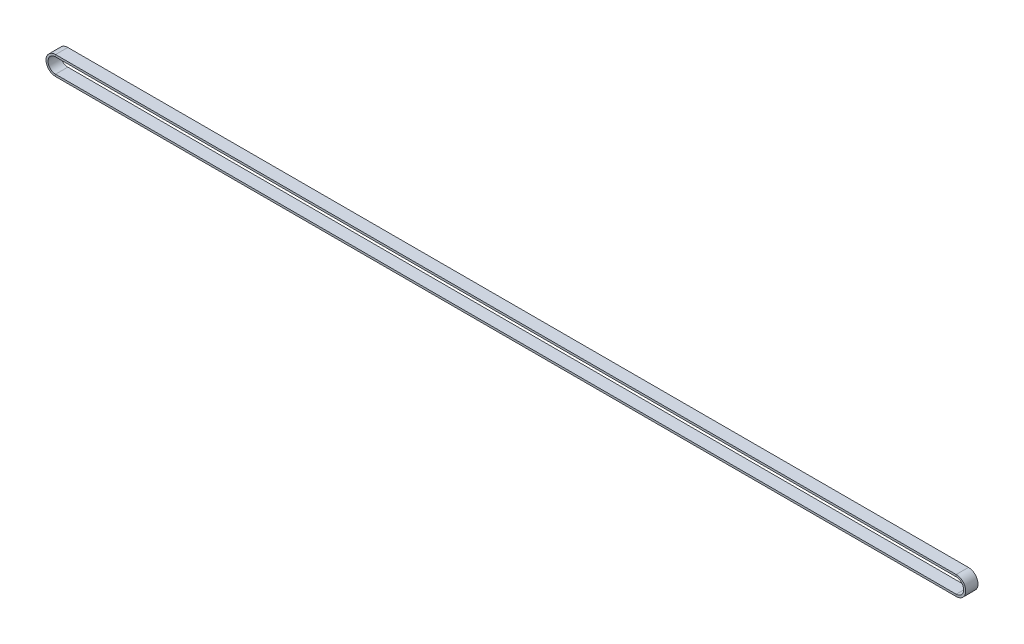
ISO-10303-21;
HEADER;
FILE_DESCRIPTION(('STEP AP214'),'2;1');
FILE_NAME('part.step','',(''),(''),'','','');
FILE_SCHEMA(('AUTOMOTIVE_DESIGN { 1 0 10303 214 1 1 1 1 }'));
ENDSEC;
DATA;
#1=APPLICATION_CONTEXT('core data for automotive mechanical design processes');
#2=APPLICATION_PROTOCOL_DEFINITION('international standard','automotive_design',2000,#1);
#3=PRODUCT_CONTEXT('',#1,'mechanical');
#4=PRODUCT('Part','Part','',(#3));
#5=PRODUCT_RELATED_PRODUCT_CATEGORY('part','',(#4));
#6=PRODUCT_DEFINITION_FORMATION('','',#4);
#7=PRODUCT_DEFINITION_CONTEXT('part definition',#1,'design');
#8=PRODUCT_DEFINITION('design','',#6,#7);
#9=PRODUCT_DEFINITION_SHAPE('','',#8);
#10=(LENGTH_UNIT() NAMED_UNIT(*) SI_UNIT(.MILLI.,.METRE.));
#11=(NAMED_UNIT(*) PLANE_ANGLE_UNIT() SI_UNIT($,.RADIAN.));
#12=(NAMED_UNIT(*) SI_UNIT($,.STERADIAN.) SOLID_ANGLE_UNIT());
#13=UNCERTAINTY_MEASURE_WITH_UNIT(LENGTH_MEASURE(1.E-05),#10,'distance_accuracy_value','');
#14=(GEOMETRIC_REPRESENTATION_CONTEXT(3) GLOBAL_UNCERTAINTY_ASSIGNED_CONTEXT((#13)) GLOBAL_UNIT_ASSIGNED_CONTEXT((#10,
#11,#12)) REPRESENTATION_CONTEXT('',''));
#15=CARTESIAN_POINT('',(0.,0.,0.));
#16=DIRECTION('',(0.,0.,1.));
#17=DIRECTION('',(1.,0.,0.));
#18=AXIS2_PLACEMENT_3D('',#15,#16,#17);
#19=CARTESIAN_POINT('',(-660.332653819081,7.00000000000147,0.));
#20=DIRECTION('',(0.,1.,0.));
#21=DIRECTION('',(-1.,0.,0.));
#22=AXIS2_PLACEMENT_3D('',#19,#20,#21);
#23=PLANE('',#22);
#24=DIRECTION('',(1.,0.,0.));
#25=VECTOR('',#24,1.);
#26=CARTESIAN_POINT('',(-660.332653819081,7.00000000000147,0.));
#27=LINE('',#26,#25);
#28=CARTESIAN_POINT('',(-660.332653819081,7.00000000000147,0.));
#29=VERTEX_POINT('',#28);
#30=CARTESIAN_POINT('',(0.,7.,0.));
#31=VERTEX_POINT('',#30);
#32=EDGE_CURVE('E11',#29,#31,#27,.T.);
#33=ORIENTED_EDGE('',*,*,#32,.T.);
#34=DIRECTION('',(0.,0.,-1.));
#35=VECTOR('',#34,1.);
#36=CARTESIAN_POINT('',(0.,7.,0.));
#37=LINE('',#36,#35);
#38=CARTESIAN_POINT('',(0.,7.,-9.));
#39=VERTEX_POINT('',#38);
#40=EDGE_CURVE('E143',#31,#39,#37,.T.);
#41=ORIENTED_EDGE('',*,*,#40,.T.);
#42=DIRECTION('',(1.,0.,0.));
#43=VECTOR('',#42,1.);
#44=CARTESIAN_POINT('',(-660.332653819081,7.00000000000147,-9.));
#45=LINE('',#44,#43);
#46=CARTESIAN_POINT('',(-660.332653819081,7.00000000000147,-9.));
#47=VERTEX_POINT('',#46);
#48=EDGE_CURVE('E149',#47,#39,#45,.T.);
#49=ORIENTED_EDGE('',*,*,#48,.F.);
#50=DIRECTION('',(0.,0.,-1.));
#51=VECTOR('',#50,1.);
#52=CARTESIAN_POINT('',(-660.332653819081,7.00000000000147,0.));
#53=LINE('',#52,#51);
#54=EDGE_CURVE('E38',#29,#47,#53,.T.);
#55=ORIENTED_EDGE('',*,*,#54,.F.);
#56=EDGE_LOOP('',(#33,#41,#49,#55));
#57=FACE_BOUND('',#56,.T.);
#58=ADVANCED_FACE('F35',(#57),#23,.T.);
#59=CARTESIAN_POINT('',(-660.332653819081,7.00000000000147,0.));
#60=DIRECTION('',(0.,0.,1.));
#61=DIRECTION('',(0.,1.,0.));
#62=AXIS2_PLACEMENT_3D('',#59,#60,#61);
#63=PLANE('',#62);
#64=DIRECTION('',(1.,0.,0.));
#65=VECTOR('',#64,1.);
#66=CARTESIAN_POINT('',(-660.332653819081,5.50000000000147,0.));
#67=LINE('',#66,#65);
#68=CARTESIAN_POINT('',(-660.332653819081,5.50000000000147,0.));
#69=VERTEX_POINT('',#68);
#70=CARTESIAN_POINT('',(0.,5.5,0.));
#71=VERTEX_POINT('',#70);
#72=EDGE_CURVE('E43',#69,#71,#67,.T.);
#73=ORIENTED_EDGE('',*,*,#72,.T.);
#74=DIRECTION('',(0.,1.,0.));
#75=VECTOR('',#74,1.);
#76=CARTESIAN_POINT('',(0.,7.,0.));
#77=LINE('',#76,#75);
#78=EDGE_CURVE('E158',#71,#31,#77,.T.);
#79=ORIENTED_EDGE('',*,*,#78,.T.);
#80=ORIENTED_EDGE('',*,*,#32,.F.);
#81=DIRECTION('',(0.,1.,0.));
#82=VECTOR('',#81,1.);
#83=CARTESIAN_POINT('',(-660.332653819081,7.00000000000147,0.));
#84=LINE('',#83,#82);
#85=EDGE_CURVE('E175',#69,#29,#84,.T.);
#86=ORIENTED_EDGE('',*,*,#85,.F.);
#87=EDGE_LOOP('',(#73,#79,#80,#86));
#88=FACE_BOUND('',#87,.T.);
#89=ADVANCED_FACE('F180',(#88),#63,.T.);
#90=CARTESIAN_POINT('',(-660.332653819081,5.50000000000147,0.));
#91=DIRECTION('',(0.,-1.,0.));
#92=DIRECTION('',(1.,0.,0.));
#93=AXIS2_PLACEMENT_3D('',#90,#91,#92);
#94=PLANE('',#93);
#95=DIRECTION('',(1.,0.,0.));
#96=VECTOR('',#95,1.);
#97=CARTESIAN_POINT('',(-660.332653819081,5.50000000000147,-9.));
#98=LINE('',#97,#96);
#99=CARTESIAN_POINT('',(-660.332653819081,5.50000000000147,-9.));
#100=VERTEX_POINT('',#99);
#101=CARTESIAN_POINT('',(0.,5.5,-9.));
#102=VERTEX_POINT('',#101);
#103=EDGE_CURVE('E155',#100,#102,#98,.T.);
#104=ORIENTED_EDGE('',*,*,#103,.T.);
#105=DIRECTION('',(0.,0.,1.));
#106=VECTOR('',#105,1.);
#107=CARTESIAN_POINT('',(0.,5.5,0.));
#108=LINE('',#107,#106);
#109=EDGE_CURVE('E136',#102,#71,#108,.T.);
#110=ORIENTED_EDGE('',*,*,#109,.T.);
#111=ORIENTED_EDGE('',*,*,#72,.F.);
#112=DIRECTION('',(0.,0.,1.));
#113=VECTOR('',#112,1.);
#114=CARTESIAN_POINT('',(-660.332653819081,5.50000000000147,0.));
#115=LINE('',#114,#113);
#116=EDGE_CURVE('E188',#100,#69,#115,.T.);
#117=ORIENTED_EDGE('',*,*,#116,.F.);
#118=EDGE_LOOP('',(#104,#110,#111,#117));
#119=FACE_BOUND('',#118,.T.);
#120=ADVANCED_FACE('F216',(#119),#94,.T.);
#121=CARTESIAN_POINT('',(-660.332653819081,1.45716771982052E-12,0.));
#122=DIRECTION('',(0.,0.,1.));
#123=DIRECTION('',(-1.,0.,0.));
#124=AXIS2_PLACEMENT_3D('',#121,#122,#123);
#125=CYLINDRICAL_SURFACE('',#124,7.00000000000001);
#126=ORIENTED_EDGE('',*,*,#54,.T.);
#127=CARTESIAN_POINT('',(-660.332653819081,1.45716771982052E-12,-9.));
#128=DIRECTION('',(0.,0.,-1.));
#129=DIRECTION('',(0.,-1.,0.));
#130=AXIS2_PLACEMENT_3D('',#127,#128,#129);
#131=CIRCLE('',#130,7.00000000000001);
#132=CARTESIAN_POINT('',(-660.332653819081,-6.99999999999853,-9.));
#133=VERTEX_POINT('',#132);
#134=EDGE_CURVE('E167',#133,#47,#131,.T.);
#135=ORIENTED_EDGE('',*,*,#134,.F.);
#136=DIRECTION('',(0.,0.,-1.));
#137=VECTOR('',#136,1.);
#138=CARTESIAN_POINT('',(-660.332653819081,-6.99999999999856,0.));
#139=LINE('',#138,#137);
#140=CARTESIAN_POINT('',(-660.332653819081,-6.99999999999853,0.));
#141=VERTEX_POINT('',#140);
#142=EDGE_CURVE('E166',#141,#133,#139,.T.);
#143=ORIENTED_EDGE('',*,*,#142,.F.);
#144=CARTESIAN_POINT('',(-660.332653819081,1.45716771982052E-12,0.));
#145=DIRECTION('',(0.,0.,-1.));
#146=DIRECTION('',(0.,-1.,0.));
#147=AXIS2_PLACEMENT_3D('',#144,#145,#146);
#148=CIRCLE('',#147,7.00000000000001);
#149=EDGE_CURVE('E51',#141,#29,#148,.T.);
#150=ORIENTED_EDGE('',*,*,#149,.T.);
#151=EDGE_LOOP('',(#126,#135,#143,#150));
#152=FACE_BOUND('',#151,.T.);
#153=ADVANCED_FACE('F176',(#152),#125,.T.);
#154=CARTESIAN_POINT('',(-660.332653819081,-6.99999999999856,0.));
#155=DIRECTION('',(0.,0.,1.));
#156=DIRECTION('',(-1.,0.,0.));
#157=AXIS2_PLACEMENT_3D('',#154,#155,#156);
#158=PLANE('',#157);
#159=ORIENTED_EDGE('',*,*,#149,.F.);
#160=DIRECTION('',(0.,-1.,0.));
#161=VECTOR('',#160,1.);
#162=CARTESIAN_POINT('',(-660.332653819081,-6.99999999999856,0.));
#163=LINE('',#162,#161);
#164=CARTESIAN_POINT('',(-660.332653819081,-5.49999999999853,0.));
#165=VERTEX_POINT('',#164);
#166=EDGE_CURVE('E170',#165,#141,#163,.T.);
#167=ORIENTED_EDGE('',*,*,#166,.F.);
#168=CARTESIAN_POINT('',(-660.332653819081,1.45716771982052E-12,0.));
#169=DIRECTION('',(0.,0.,-1.));
#170=DIRECTION('',(0.,-1.,0.));
#171=AXIS2_PLACEMENT_3D('',#168,#169,#170);
#172=CIRCLE('',#171,5.50000000000001);
#173=EDGE_CURVE('E59',#165,#69,#172,.T.);
#174=ORIENTED_EDGE('',*,*,#173,.T.);
#175=ORIENTED_EDGE('',*,*,#85,.T.);
#176=EDGE_LOOP('',(#159,#167,#174,#175));
#177=FACE_BOUND('',#176,.T.);
#178=ADVANCED_FACE('F232',(#177),#158,.T.);
#179=CARTESIAN_POINT('',(-660.332653819081,1.45716771982052E-12,0.));
#180=DIRECTION('',(0.,0.,1.));
#181=DIRECTION('',(-1.,0.,0.));
#182=AXIS2_PLACEMENT_3D('',#179,#180,#181);
#183=CYLINDRICAL_SURFACE('',#182,5.50000000000001);
#184=ORIENTED_EDGE('',*,*,#173,.F.);
#185=DIRECTION('',(0.,0.,1.));
#186=VECTOR('',#185,1.);
#187=CARTESIAN_POINT('',(-660.332653819081,-5.49999999999856,0.));
#188=LINE('',#187,#186);
#189=CARTESIAN_POINT('',(-660.332653819081,-5.49999999999853,-9.));
#190=VERTEX_POINT('',#189);
#191=EDGE_CURVE('E192',#190,#165,#188,.T.);
#192=ORIENTED_EDGE('',*,*,#191,.F.);
#193=CARTESIAN_POINT('',(-660.332653819081,1.45716771982052E-12,-9.));
#194=DIRECTION('',(0.,0.,-1.));
#195=DIRECTION('',(0.,-1.,0.));
#196=AXIS2_PLACEMENT_3D('',#193,#194,#195);
#197=CIRCLE('',#196,5.50000000000001);
#198=EDGE_CURVE('E190',#190,#100,#197,.T.);
#199=ORIENTED_EDGE('',*,*,#198,.T.);
#200=ORIENTED_EDGE('',*,*,#116,.T.);
#201=EDGE_LOOP('',(#184,#192,#199,#200));
#202=FACE_BOUND('',#201,.T.);
#203=ADVANCED_FACE('F219',(#202),#183,.F.);
#204=CARTESIAN_POINT('',(-660.332653819081,-6.99999999999856,-9.));
#205=DIRECTION('',(0.,0.,-1.));
#206=DIRECTION('',(1.,0.,0.));
#207=AXIS2_PLACEMENT_3D('',#204,#205,#206);
#208=PLANE('',#207);
#209=ORIENTED_EDGE('',*,*,#198,.F.);
#210=DIRECTION('',(0.,1.,0.));
#211=VECTOR('',#210,1.);
#212=CARTESIAN_POINT('',(-660.332653819081,-6.99999999999856,-9.));
#213=LINE('',#212,#211);
#214=EDGE_CURVE('E205',#133,#190,#213,.T.);
#215=ORIENTED_EDGE('',*,*,#214,.F.);
#216=ORIENTED_EDGE('',*,*,#134,.T.);
#217=DIRECTION('',(0.,-1.,0.));
#218=VECTOR('',#217,1.);
#219=CARTESIAN_POINT('',(-660.332653819081,7.00000000000147,-9.));
#220=LINE('',#219,#218);
#221=EDGE_CURVE('E151',#47,#100,#220,.T.);
#222=ORIENTED_EDGE('',*,*,#221,.T.);
#223=EDGE_LOOP('',(#209,#215,#216,#222));
#224=FACE_BOUND('',#223,.T.);
#225=ADVANCED_FACE('F222',(#224),#208,.T.);
#226=CARTESIAN_POINT('',(0.,-7.,0.));
#227=DIRECTION('',(0.,-1.,0.));
#228=DIRECTION('',(1.,0.,0.));
#229=AXIS2_PLACEMENT_3D('',#226,#227,#228);
#230=PLANE('',#229);
#231=ORIENTED_EDGE('',*,*,#142,.T.);
#232=DIRECTION('',(-1.,0.,0.));
#233=VECTOR('',#232,1.);
#234=CARTESIAN_POINT('',(0.,-7.,-9.));
#235=LINE('',#234,#233);
#236=CARTESIAN_POINT('',(0.,-7.00000000000003,-9.));
#237=VERTEX_POINT('',#236);
#238=EDGE_CURVE('E164',#237,#133,#235,.T.);
#239=ORIENTED_EDGE('',*,*,#238,.F.);
#240=DIRECTION('',(0.,0.,-1.));
#241=VECTOR('',#240,1.);
#242=CARTESIAN_POINT('',(0.,-7.,0.));
#243=LINE('',#242,#241);
#244=CARTESIAN_POINT('',(0.,-7.00000000000003,0.));
#245=VERTEX_POINT('',#244);
#246=EDGE_CURVE('E144',#245,#237,#243,.T.);
#247=ORIENTED_EDGE('',*,*,#246,.F.);
#248=DIRECTION('',(-1.,0.,0.));
#249=VECTOR('',#248,1.);
#250=CARTESIAN_POINT('',(0.,-7.,0.));
#251=LINE('',#250,#249);
#252=EDGE_CURVE('E83',#245,#141,#251,.T.);
#253=ORIENTED_EDGE('',*,*,#252,.T.);
#254=EDGE_LOOP('',(#231,#239,#247,#253));
#255=FACE_BOUND('',#254,.T.);
#256=ADVANCED_FACE('F224',(#255),#230,.T.);
#257=CARTESIAN_POINT('',(0.,-7.,0.));
#258=DIRECTION('',(0.,0.,1.));
#259=DIRECTION('',(0.,1.,0.));
#260=AXIS2_PLACEMENT_3D('',#257,#258,#259);
#261=PLANE('',#260);
#262=ORIENTED_EDGE('',*,*,#252,.F.);
#263=DIRECTION('',(0.,-1.,0.));
#264=VECTOR('',#263,1.);
#265=CARTESIAN_POINT('',(0.,-7.,0.));
#266=LINE('',#265,#264);
#267=CARTESIAN_POINT('',(0.,-5.50000000000003,0.));
#268=VERTEX_POINT('',#267);
#269=EDGE_CURVE('E183',#268,#245,#266,.T.);
#270=ORIENTED_EDGE('',*,*,#269,.F.);
#271=DIRECTION('',(-1.,0.,0.));
#272=VECTOR('',#271,1.);
#273=CARTESIAN_POINT('',(0.,-5.5,0.));
#274=LINE('',#273,#272);
#275=EDGE_CURVE('E92',#268,#165,#274,.T.);
#276=ORIENTED_EDGE('',*,*,#275,.T.);
#277=ORIENTED_EDGE('',*,*,#166,.T.);
#278=EDGE_LOOP('',(#262,#270,#276,#277));
#279=FACE_BOUND('',#278,.T.);
#280=ADVANCED_FACE('F230',(#279),#261,.T.);
#281=CARTESIAN_POINT('',(0.,-5.5,0.));
#282=DIRECTION('',(0.,1.,0.));
#283=DIRECTION('',(-1.,0.,0.));
#284=AXIS2_PLACEMENT_3D('',#281,#282,#283);
#285=PLANE('',#284);
#286=ORIENTED_EDGE('',*,*,#275,.F.);
#287=DIRECTION('',(0.,0.,1.));
#288=VECTOR('',#287,1.);
#289=CARTESIAN_POINT('',(0.,-5.5,0.));
#290=LINE('',#289,#288);
#291=CARTESIAN_POINT('',(0.,-5.50000000000003,-9.));
#292=VERTEX_POINT('',#291);
#293=EDGE_CURVE('E195',#292,#268,#290,.T.);
#294=ORIENTED_EDGE('',*,*,#293,.F.);
#295=DIRECTION('',(-1.,0.,0.));
#296=VECTOR('',#295,1.);
#297=CARTESIAN_POINT('',(0.,-5.5,-9.));
#298=LINE('',#297,#296);
#299=EDGE_CURVE('E99',#292,#190,#298,.T.);
#300=ORIENTED_EDGE('',*,*,#299,.T.);
#301=ORIENTED_EDGE('',*,*,#191,.T.);
#302=EDGE_LOOP('',(#286,#294,#300,#301));
#303=FACE_BOUND('',#302,.T.);
#304=ADVANCED_FACE('F213',(#303),#285,.T.);
#305=CARTESIAN_POINT('',(0.,-7.,-9.));
#306=DIRECTION('',(0.,0.,-1.));
#307=DIRECTION('',(1.,0.,0.));
#308=AXIS2_PLACEMENT_3D('',#305,#306,#307);
#309=PLANE('',#308);
#310=ORIENTED_EDGE('',*,*,#299,.F.);
#311=DIRECTION('',(0.,1.,0.));
#312=VECTOR('',#311,1.);
#313=CARTESIAN_POINT('',(0.,-7.,-9.));
#314=LINE('',#313,#312);
#315=EDGE_CURVE('E146',#237,#292,#314,.T.);
#316=ORIENTED_EDGE('',*,*,#315,.F.);
#317=ORIENTED_EDGE('',*,*,#238,.T.);
#318=ORIENTED_EDGE('',*,*,#214,.T.);
#319=EDGE_LOOP('',(#310,#316,#317,#318));
#320=FACE_BOUND('',#319,.T.);
#321=ADVANCED_FACE('F210',(#320),#309,.T.);
#322=CARTESIAN_POINT('',(0.,0.,0.));
#323=DIRECTION('',(0.,0.,1.));
#324=DIRECTION('',(-1.,0.,0.));
#325=AXIS2_PLACEMENT_3D('',#322,#323,#324);
#326=CYLINDRICAL_SURFACE('',#325,7.00000000000001);
#327=ORIENTED_EDGE('',*,*,#246,.T.);
#328=CARTESIAN_POINT('',(0.,0.,-9.));
#329=DIRECTION('',(0.,0.,-1.));
#330=DIRECTION('',(0.,1.,0.));
#331=AXIS2_PLACEMENT_3D('',#328,#329,#330);
#332=CIRCLE('',#331,7.00000000000001);
#333=EDGE_CURVE('E131',#39,#237,#332,.T.);
#334=ORIENTED_EDGE('',*,*,#333,.F.);
#335=ORIENTED_EDGE('',*,*,#40,.F.);
#336=CARTESIAN_POINT('',(0.,0.,0.));
#337=DIRECTION('',(0.,0.,-1.));
#338=DIRECTION('',(0.,1.,0.));
#339=AXIS2_PLACEMENT_3D('',#336,#337,#338);
#340=CIRCLE('',#339,7.00000000000001);
#341=EDGE_CURVE('E165',#31,#245,#340,.T.);
#342=ORIENTED_EDGE('',*,*,#341,.T.);
#343=EDGE_LOOP('',(#327,#334,#335,#342));
#344=FACE_BOUND('',#343,.T.);
#345=ADVANCED_FACE('F141',(#344),#326,.T.);
#346=CARTESIAN_POINT('',(0.,7.,0.));
#347=DIRECTION('',(0.,0.,1.));
#348=DIRECTION('',(-1.,0.,0.));
#349=AXIS2_PLACEMENT_3D('',#346,#347,#348);
#350=PLANE('',#349);
#351=ORIENTED_EDGE('',*,*,#341,.F.);
#352=ORIENTED_EDGE('',*,*,#78,.F.);
#353=CARTESIAN_POINT('',(0.,0.,0.));
#354=DIRECTION('',(0.,0.,-1.));
#355=DIRECTION('',(0.,1.,0.));
#356=AXIS2_PLACEMENT_3D('',#353,#354,#355);
#357=CIRCLE('',#356,5.50000000000001);
#358=EDGE_CURVE('E112',#71,#268,#357,.T.);
#359=ORIENTED_EDGE('',*,*,#358,.T.);
#360=ORIENTED_EDGE('',*,*,#269,.T.);
#361=EDGE_LOOP('',(#351,#352,#359,#360));
#362=FACE_BOUND('',#361,.T.);
#363=ADVANCED_FACE('F182',(#362),#350,.T.);
#364=CARTESIAN_POINT('',(0.,0.,0.));
#365=DIRECTION('',(0.,0.,1.));
#366=DIRECTION('',(-1.,0.,0.));
#367=AXIS2_PLACEMENT_3D('',#364,#365,#366);
#368=CYLINDRICAL_SURFACE('',#367,5.50000000000001);
#369=ORIENTED_EDGE('',*,*,#358,.F.);
#370=ORIENTED_EDGE('',*,*,#109,.F.);
#371=CARTESIAN_POINT('',(0.,0.,-9.));
#372=DIRECTION('',(0.,0.,-1.));
#373=DIRECTION('',(0.,1.,0.));
#374=AXIS2_PLACEMENT_3D('',#371,#372,#373);
#375=CIRCLE('',#374,5.50000000000001);
#376=EDGE_CURVE('E118',#102,#292,#375,.T.);
#377=ORIENTED_EDGE('',*,*,#376,.T.);
#378=ORIENTED_EDGE('',*,*,#293,.T.);
#379=EDGE_LOOP('',(#369,#370,#377,#378));
#380=FACE_BOUND('',#379,.T.);
#381=ADVANCED_FACE('F214',(#380),#368,.F.);
#382=CARTESIAN_POINT('',(0.,7.,-9.));
#383=DIRECTION('',(0.,0.,-1.));
#384=DIRECTION('',(1.,0.,0.));
#385=AXIS2_PLACEMENT_3D('',#382,#383,#384);
#386=PLANE('',#385);
#387=ORIENTED_EDGE('',*,*,#376,.F.);
#388=DIRECTION('',(0.,-1.,0.));
#389=VECTOR('',#388,1.);
#390=CARTESIAN_POINT('',(0.,7.,-9.));
#391=LINE('',#390,#389);
#392=EDGE_CURVE('E128',#39,#102,#391,.T.);
#393=ORIENTED_EDGE('',*,*,#392,.F.);
#394=ORIENTED_EDGE('',*,*,#333,.T.);
#395=ORIENTED_EDGE('',*,*,#315,.T.);
#396=EDGE_LOOP('',(#387,#393,#394,#395));
#397=FACE_BOUND('',#396,.T.);
#398=ADVANCED_FACE('F130',(#397),#386,.T.);
#399=CARTESIAN_POINT('',(-660.332653819081,7.00000000000147,-9.));
#400=DIRECTION('',(0.,0.,-1.));
#401=DIRECTION('',(1.,0.,0.));
#402=AXIS2_PLACEMENT_3D('',#399,#400,#401);
#403=PLANE('',#402);
#404=ORIENTED_EDGE('',*,*,#221,.F.);
#405=ORIENTED_EDGE('',*,*,#48,.T.);
#406=ORIENTED_EDGE('',*,*,#392,.T.);
#407=ORIENTED_EDGE('',*,*,#103,.F.);
#408=EDGE_LOOP('',(#404,#405,#406,#407));
#409=FACE_BOUND('',#408,.T.);
#410=ADVANCED_FACE('F150',(#409),#403,.T.);
#411=CLOSED_SHELL('',(#58,#89,#120,#153,#178,#203,#225,#256,#280,#304,#321,#345,#363,#381,#398,#410));
#412=MANIFOLD_SOLID_BREP('B2',#411);
#413=ADVANCED_BREP_SHAPE_REPRESENTATION('',(#18,#412),#14);
#414=SHAPE_DEFINITION_REPRESENTATION(#9,#413);
ENDSEC;
END-ISO-10303-21;
